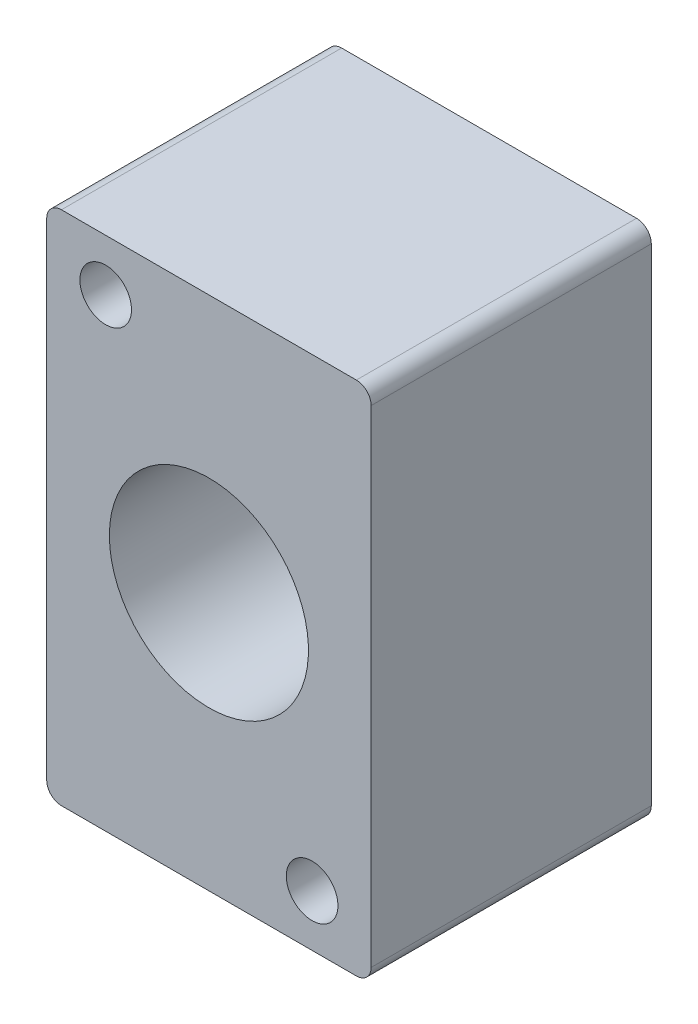
ISO-10303-21;
HEADER;
FILE_DESCRIPTION(('STEP AP214'),'2;1');
FILE_NAME('part.step','',(''),(''),'','','');
FILE_SCHEMA(('AUTOMOTIVE_DESIGN { 1 0 10303 214 1 1 1 1 }'));
ENDSEC;
DATA;
#1=APPLICATION_CONTEXT('core data for automotive mechanical design processes');
#2=APPLICATION_PROTOCOL_DEFINITION('international standard','automotive_design',2000,#1);
#3=PRODUCT_CONTEXT('',#1,'mechanical');
#4=PRODUCT('Part','Part','',(#3));
#5=PRODUCT_RELATED_PRODUCT_CATEGORY('part','',(#4));
#6=PRODUCT_DEFINITION_FORMATION('','',#4);
#7=PRODUCT_DEFINITION_CONTEXT('part definition',#1,'design');
#8=PRODUCT_DEFINITION('design','',#6,#7);
#9=PRODUCT_DEFINITION_SHAPE('','',#8);
#10=(LENGTH_UNIT() NAMED_UNIT(*) SI_UNIT(.MILLI.,.METRE.));
#11=(NAMED_UNIT(*) PLANE_ANGLE_UNIT() SI_UNIT($,.RADIAN.));
#12=(NAMED_UNIT(*) SI_UNIT($,.STERADIAN.) SOLID_ANGLE_UNIT());
#13=UNCERTAINTY_MEASURE_WITH_UNIT(LENGTH_MEASURE(1.E-05),#10,'distance_accuracy_value','');
#14=(GEOMETRIC_REPRESENTATION_CONTEXT(3) GLOBAL_UNCERTAINTY_ASSIGNED_CONTEXT((#13)) GLOBAL_UNIT_ASSIGNED_CONTEXT((#10,
#11,#12)) REPRESENTATION_CONTEXT('',''));
#15=CARTESIAN_POINT('',(0.,0.,0.));
#16=DIRECTION('',(0.,0.,1.));
#17=DIRECTION('',(1.,0.,0.));
#18=AXIS2_PLACEMENT_3D('',#15,#16,#17);
#19=CARTESIAN_POINT('',(4.13907958301551,17.4504195270786,44.));
#20=DIRECTION('',(0.,0.,1.));
#21=DIRECTION('',(1.,0.,0.));
#22=AXIS2_PLACEMENT_3D('',#19,#20,#21);
#23=CYLINDRICAL_SURFACE('',#22,1.);
#24=CARTESIAN_POINT('',(4.13907958301551,17.4504195270786,44.));
#25=DIRECTION('',(0.,0.,1.));
#26=DIRECTION('',(1.,0.,0.));
#27=AXIS2_PLACEMENT_3D('',#24,#25,#26);
#28=CIRCLE('',#27,1.);
#29=CARTESIAN_POINT('',(4.13907958301551,18.4504195270786,44.));
#30=VERTEX_POINT('',#29);
#31=CARTESIAN_POINT('',(5.13907958301551,17.4504195270786,44.));
#32=VERTEX_POINT('',#31);
#33=EDGE_CURVE('E89',#30,#32,#28,.F.);
#34=ORIENTED_EDGE('',*,*,#33,.T.);
#35=DIRECTION('',(0.,0.,1.));
#36=VECTOR('',#35,1.);
#37=CARTESIAN_POINT('',(5.13907958301551,17.4504195270786,44.));
#38=LINE('',#37,#36);
#39=CARTESIAN_POINT('',(5.13907958301551,17.4504195270786,25.));
#40=VERTEX_POINT('',#39);
#41=EDGE_CURVE('E91',#32,#40,#38,.F.);
#42=ORIENTED_EDGE('',*,*,#41,.T.);
#43=CARTESIAN_POINT('',(4.13907958301551,17.4504195270786,25.));
#44=DIRECTION('',(0.,0.,1.));
#45=DIRECTION('',(1.,0.,0.));
#46=AXIS2_PLACEMENT_3D('',#43,#44,#45);
#47=CIRCLE('',#46,1.);
#48=CARTESIAN_POINT('',(4.13907958301551,18.4504195270786,25.));
#49=VERTEX_POINT('',#48);
#50=EDGE_CURVE('E21',#40,#49,#47,.T.);
#51=ORIENTED_EDGE('',*,*,#50,.T.);
#52=DIRECTION('',(0.,0.,-1.));
#53=VECTOR('',#52,1.);
#54=CARTESIAN_POINT('',(4.13907958301551,18.4504195270786,44.));
#55=LINE('',#54,#53);
#56=EDGE_CURVE('E96',#49,#30,#55,.F.);
#57=ORIENTED_EDGE('',*,*,#56,.T.);
#58=EDGE_LOOP('',(#34,#42,#51,#57));
#59=FACE_BOUND('',#58,.T.);
#60=ADVANCED_FACE('F18',(#59),#23,.T.);
#61=CARTESIAN_POINT('',(4.13907958301551,-15.5495804729214,44.));
#62=DIRECTION('',(0.,0.,1.));
#63=DIRECTION('',(1.,0.,0.));
#64=AXIS2_PLACEMENT_3D('',#61,#62,#63);
#65=CYLINDRICAL_SURFACE('',#64,1.);
#66=CARTESIAN_POINT('',(4.13907958301551,-15.5495804729214,44.));
#67=DIRECTION('',(0.,0.,1.));
#68=DIRECTION('',(1.,0.,0.));
#69=AXIS2_PLACEMENT_3D('',#66,#67,#68);
#70=CIRCLE('',#69,1.);
#71=CARTESIAN_POINT('',(5.13907958301551,-15.5495804729214,44.));
#72=VERTEX_POINT('',#71);
#73=CARTESIAN_POINT('',(4.13907958301551,-16.5495804729214,44.));
#74=VERTEX_POINT('',#73);
#75=EDGE_CURVE('E114',#72,#74,#70,.F.);
#76=ORIENTED_EDGE('',*,*,#75,.T.);
#77=DIRECTION('',(0.,0.,1.));
#78=VECTOR('',#77,1.);
#79=CARTESIAN_POINT('',(4.13907958301551,-16.5495804729214,44.));
#80=LINE('',#79,#78);
#81=CARTESIAN_POINT('',(4.13907958301551,-16.5495804729214,25.));
#82=VERTEX_POINT('',#81);
#83=EDGE_CURVE('E102',#74,#82,#80,.F.);
#84=ORIENTED_EDGE('',*,*,#83,.T.);
#85=CARTESIAN_POINT('',(4.13907958301551,-15.5495804729214,25.));
#86=DIRECTION('',(0.,0.,1.));
#87=DIRECTION('',(1.,0.,0.));
#88=AXIS2_PLACEMENT_3D('',#85,#86,#87);
#89=CIRCLE('',#88,1.);
#90=CARTESIAN_POINT('',(5.13907958301551,-15.5495804729214,25.));
#91=VERTEX_POINT('',#90);
#92=EDGE_CURVE('E148',#82,#91,#89,.T.);
#93=ORIENTED_EDGE('',*,*,#92,.T.);
#94=DIRECTION('',(0.,0.,1.));
#95=VECTOR('',#94,1.);
#96=CARTESIAN_POINT('',(5.13907958301552,-15.5495804729214,44.));
#97=LINE('',#96,#95);
#98=EDGE_CURVE('E95',#91,#72,#97,.T.);
#99=ORIENTED_EDGE('',*,*,#98,.T.);
#100=EDGE_LOOP('',(#76,#84,#93,#99));
#101=FACE_BOUND('',#100,.T.);
#102=ADVANCED_FACE('F150',(#101),#65,.T.);
#103=CARTESIAN_POINT('',(-16.8609204169845,18.4504195270786,44.));
#104=DIRECTION('',(0.,-1.,0.));
#105=DIRECTION('',(0.,0.,-1.));
#106=AXIS2_PLACEMENT_3D('',#103,#104,#105);
#107=PLANE('',#106);
#108=DIRECTION('',(-1.,0.,0.));
#109=VECTOR('',#108,1.);
#110=CARTESIAN_POINT('',(-5.86092041698449,18.4504195270786,44.));
#111=LINE('',#110,#109);
#112=CARTESIAN_POINT('',(-15.8609204169845,18.4504195270786,44.));
#113=VERTEX_POINT('',#112);
#114=EDGE_CURVE('E136',#113,#30,#111,.F.);
#115=ORIENTED_EDGE('',*,*,#114,.T.);
#116=ORIENTED_EDGE('',*,*,#56,.F.);
#117=DIRECTION('',(-1.,0.,0.));
#118=VECTOR('',#117,1.);
#119=CARTESIAN_POINT('',(-5.86092041698449,18.4504195270786,25.));
#120=LINE('',#119,#118);
#121=CARTESIAN_POINT('',(-15.8609204169845,18.4504195270786,25.));
#122=VERTEX_POINT('',#121);
#123=EDGE_CURVE('E85',#122,#49,#120,.F.);
#124=ORIENTED_EDGE('',*,*,#123,.F.);
#125=DIRECTION('',(0.,0.,1.));
#126=VECTOR('',#125,1.);
#127=CARTESIAN_POINT('',(-15.8609204169845,18.4504195270786,44.));
#128=LINE('',#127,#126);
#129=EDGE_CURVE('E115',#113,#122,#128,.F.);
#130=ORIENTED_EDGE('',*,*,#129,.F.);
#131=EDGE_LOOP('',(#115,#116,#124,#130));
#132=FACE_BOUND('',#131,.T.);
#133=ADVANCED_FACE('F181',(#132),#107,.F.);
#134=CARTESIAN_POINT('',(5.13907958301551,18.4504195270786,44.));
#135=DIRECTION('',(-1.,0.,0.));
#136=DIRECTION('',(0.,-1.,0.));
#137=AXIS2_PLACEMENT_3D('',#134,#135,#136);
#138=PLANE('',#137);
#139=DIRECTION('',(0.,1.,0.));
#140=VECTOR('',#139,1.);
#141=CARTESIAN_POINT('',(5.13907958301551,0.950419527078566,25.));
#142=LINE('',#141,#140);
#143=EDGE_CURVE('E83',#40,#91,#142,.F.);
#144=ORIENTED_EDGE('',*,*,#143,.F.);
#145=ORIENTED_EDGE('',*,*,#41,.F.);
#146=DIRECTION('',(0.,1.,0.));
#147=VECTOR('',#146,1.);
#148=CARTESIAN_POINT('',(5.13907958301551,0.950419527078566,44.));
#149=LINE('',#148,#147);
#150=EDGE_CURVE('E162',#32,#72,#149,.F.);
#151=ORIENTED_EDGE('',*,*,#150,.T.);
#152=ORIENTED_EDGE('',*,*,#98,.F.);
#153=EDGE_LOOP('',(#144,#145,#151,#152));
#154=FACE_BOUND('',#153,.T.);
#155=ADVANCED_FACE('F99',(#154),#138,.F.);
#156=CARTESIAN_POINT('',(-5.86092041698449,0.950419527078566,25.));
#157=DIRECTION('',(0.,0.,-1.));
#158=DIRECTION('',(-1.,0.,0.));
#159=AXIS2_PLACEMENT_3D('',#156,#157,#158);
#160=CYLINDRICAL_SURFACE('',#159,6.75);
#161=CARTESIAN_POINT('',(-5.86092041698449,0.950419527078566,44.));
#162=DIRECTION('',(0.,0.,-1.));
#163=DIRECTION('',(-1.,0.,0.));
#164=AXIS2_PLACEMENT_3D('',#161,#162,#163);
#165=CIRCLE('',#164,6.75);
#166=CARTESIAN_POINT('',(-12.6109204169845,0.950419527078566,44.));
#167=VERTEX_POINT('',#166);
#168=EDGE_CURVE('E130',#167,#167,#165,.F.);
#169=ORIENTED_EDGE('',*,*,#168,.T.);
#170=EDGE_LOOP('',(#169));
#171=FACE_BOUND('',#170,.T.);
#172=CARTESIAN_POINT('',(-5.86092041698449,0.950419527078566,25.));
#173=DIRECTION('',(0.,0.,-1.));
#174=DIRECTION('',(-1.,0.,0.));
#175=AXIS2_PLACEMENT_3D('',#172,#173,#174);
#176=CIRCLE('',#175,6.75);
#177=CARTESIAN_POINT('',(-12.6109204169845,0.950419527078566,25.));
#178=VERTEX_POINT('',#177);
#179=EDGE_CURVE('E144',#178,#178,#176,.F.);
#180=ORIENTED_EDGE('',*,*,#179,.F.);
#181=EDGE_LOOP('',(#180));
#182=FACE_BOUND('',#181,.T.);
#183=ADVANCED_FACE('F190',(#171,#182),#160,.F.);
#184=CARTESIAN_POINT('',(-12.8609204169845,14.9504195270786,25.));
#185=DIRECTION('',(0.,0.,-1.));
#186=DIRECTION('',(-1.,0.,0.));
#187=AXIS2_PLACEMENT_3D('',#184,#185,#186);
#188=CYLINDRICAL_SURFACE('',#187,1.75);
#189=CARTESIAN_POINT('',(-12.8609204169845,14.9504195270786,44.));
#190=DIRECTION('',(0.,0.,-1.));
#191=DIRECTION('',(-1.,0.,0.));
#192=AXIS2_PLACEMENT_3D('',#189,#190,#191);
#193=CIRCLE('',#192,1.75);
#194=CARTESIAN_POINT('',(-14.6109204169845,14.9504195270786,44.));
#195=VERTEX_POINT('',#194);
#196=EDGE_CURVE('E127',#195,#195,#193,.F.);
#197=ORIENTED_EDGE('',*,*,#196,.T.);
#198=EDGE_LOOP('',(#197));
#199=FACE_BOUND('',#198,.T.);
#200=CARTESIAN_POINT('',(-12.8609204169845,14.9504195270786,25.));
#201=DIRECTION('',(0.,0.,-1.));
#202=DIRECTION('',(-1.,0.,0.));
#203=AXIS2_PLACEMENT_3D('',#200,#201,#202);
#204=CIRCLE('',#203,1.75);
#205=CARTESIAN_POINT('',(-14.6109204169845,14.9504195270786,25.));
#206=VERTEX_POINT('',#205);
#207=EDGE_CURVE('E141',#206,#206,#204,.F.);
#208=ORIENTED_EDGE('',*,*,#207,.F.);
#209=EDGE_LOOP('',(#208));
#210=FACE_BOUND('',#209,.T.);
#211=ADVANCED_FACE('F212',(#199,#210),#188,.F.);
#212=CARTESIAN_POINT('',(1.13907958301551,-13.0495804729214,25.));
#213=DIRECTION('',(0.,0.,-1.));
#214=DIRECTION('',(-1.,0.,0.));
#215=AXIS2_PLACEMENT_3D('',#212,#213,#214);
#216=CYLINDRICAL_SURFACE('',#215,1.75);
#217=CARTESIAN_POINT('',(1.13907958301551,-13.0495804729214,44.));
#218=DIRECTION('',(0.,0.,-1.));
#219=DIRECTION('',(-1.,0.,0.));
#220=AXIS2_PLACEMENT_3D('',#217,#218,#219);
#221=CIRCLE('',#220,1.75);
#222=CARTESIAN_POINT('',(-0.610920416984484,-13.0495804729214,44.));
#223=VERTEX_POINT('',#222);
#224=EDGE_CURVE('E124',#223,#223,#221,.F.);
#225=ORIENTED_EDGE('',*,*,#224,.T.);
#226=EDGE_LOOP('',(#225));
#227=FACE_BOUND('',#226,.T.);
#228=CARTESIAN_POINT('',(1.13907958301551,-13.0495804729214,25.));
#229=DIRECTION('',(0.,0.,-1.));
#230=DIRECTION('',(-1.,0.,0.));
#231=AXIS2_PLACEMENT_3D('',#228,#229,#230);
#232=CIRCLE('',#231,1.75);
#233=CARTESIAN_POINT('',(-0.610920416984484,-13.0495804729214,25.));
#234=VERTEX_POINT('',#233);
#235=EDGE_CURVE('E138',#234,#234,#232,.F.);
#236=ORIENTED_EDGE('',*,*,#235,.F.);
#237=EDGE_LOOP('',(#236));
#238=FACE_BOUND('',#237,.T.);
#239=ADVANCED_FACE('F209',(#227,#238),#216,.F.);
#240=CARTESIAN_POINT('',(5.13907958301552,-16.5495804729214,44.));
#241=DIRECTION('',(0.,1.,0.));
#242=DIRECTION('',(0.,0.,1.));
#243=AXIS2_PLACEMENT_3D('',#240,#241,#242);
#244=PLANE('',#243);
#245=DIRECTION('',(-1.,0.,0.));
#246=VECTOR('',#245,1.);
#247=CARTESIAN_POINT('',(-5.86092041698449,-16.5495804729214,25.));
#248=LINE('',#247,#246);
#249=CARTESIAN_POINT('',(-15.8609204169845,-16.5495804729214,25.));
#250=VERTEX_POINT('',#249);
#251=EDGE_CURVE('E101',#82,#250,#248,.T.);
#252=ORIENTED_EDGE('',*,*,#251,.F.);
#253=ORIENTED_EDGE('',*,*,#83,.F.);
#254=DIRECTION('',(-1.,0.,0.));
#255=VECTOR('',#254,1.);
#256=CARTESIAN_POINT('',(-5.86092041698449,-16.5495804729214,44.));
#257=LINE('',#256,#255);
#258=CARTESIAN_POINT('',(-15.8609204169845,-16.5495804729214,44.));
#259=VERTEX_POINT('',#258);
#260=EDGE_CURVE('E133',#74,#259,#257,.T.);
#261=ORIENTED_EDGE('',*,*,#260,.T.);
#262=DIRECTION('',(0.,0.,1.));
#263=VECTOR('',#262,1.);
#264=CARTESIAN_POINT('',(-15.8609204169845,-16.5495804729214,44.));
#265=LINE('',#264,#263);
#266=EDGE_CURVE('E109',#250,#259,#265,.T.);
#267=ORIENTED_EDGE('',*,*,#266,.F.);
#268=EDGE_LOOP('',(#252,#253,#261,#267));
#269=FACE_BOUND('',#268,.T.);
#270=ADVANCED_FACE('F159',(#269),#244,.F.);
#271=CARTESIAN_POINT('',(-5.86092041698449,0.950419527078566,25.));
#272=DIRECTION('',(0.,0.,-1.));
#273=DIRECTION('',(-1.,0.,0.));
#274=AXIS2_PLACEMENT_3D('',#271,#272,#273);
#275=PLANE('',#274);
#276=ORIENTED_EDGE('',*,*,#235,.T.);
#277=EDGE_LOOP('',(#276));
#278=FACE_BOUND('',#277,.T.);
#279=ORIENTED_EDGE('',*,*,#207,.T.);
#280=EDGE_LOOP('',(#279));
#281=FACE_BOUND('',#280,.T.);
#282=ORIENTED_EDGE('',*,*,#179,.T.);
#283=EDGE_LOOP('',(#282));
#284=FACE_BOUND('',#283,.T.);
#285=ORIENTED_EDGE('',*,*,#123,.T.);
#286=ORIENTED_EDGE('',*,*,#50,.F.);
#287=ORIENTED_EDGE('',*,*,#143,.T.);
#288=ORIENTED_EDGE('',*,*,#92,.F.);
#289=ORIENTED_EDGE('',*,*,#251,.T.);
#290=CARTESIAN_POINT('',(-15.8609204169845,-15.5495804729214,25.));
#291=DIRECTION('',(0.,0.,1.));
#292=DIRECTION('',(1.,0.,0.));
#293=AXIS2_PLACEMENT_3D('',#290,#291,#292);
#294=CIRCLE('',#293,1.);
#295=CARTESIAN_POINT('',(-16.8609204169845,-15.5495804729214,25.));
#296=VERTEX_POINT('',#295);
#297=EDGE_CURVE('E110',#296,#250,#294,.T.);
#298=ORIENTED_EDGE('',*,*,#297,.F.);
#299=DIRECTION('',(0.,1.,0.));
#300=VECTOR('',#299,1.);
#301=CARTESIAN_POINT('',(-16.8609204169845,-16.5495804729214,25.));
#302=LINE('',#301,#300);
#303=CARTESIAN_POINT('',(-16.8609204169845,17.4504195270786,25.));
#304=VERTEX_POINT('',#303);
#305=EDGE_CURVE('E121',#296,#304,#302,.T.);
#306=ORIENTED_EDGE('',*,*,#305,.T.);
#307=CARTESIAN_POINT('',(-15.8609204169845,17.4504195270786,25.));
#308=DIRECTION('',(0.,0.,1.));
#309=DIRECTION('',(1.,0.,0.));
#310=AXIS2_PLACEMENT_3D('',#307,#308,#309);
#311=CIRCLE('',#310,1.);
#312=EDGE_CURVE('E119',#122,#304,#311,.T.);
#313=ORIENTED_EDGE('',*,*,#312,.F.);
#314=EDGE_LOOP('',(#285,#286,#287,#288,#289,#298,#306,#313));
#315=FACE_BOUND('',#314,.T.);
#316=ADVANCED_FACE('F81',(#278,#281,#284,#315),#275,.T.);
#317=CARTESIAN_POINT('',(-15.8609204169845,17.4504195270786,44.));
#318=DIRECTION('',(0.,0.,1.));
#319=DIRECTION('',(1.,0.,0.));
#320=AXIS2_PLACEMENT_3D('',#317,#318,#319);
#321=CYLINDRICAL_SURFACE('',#320,1.);
#322=CARTESIAN_POINT('',(-15.8609204169845,17.4504195270786,44.));
#323=DIRECTION('',(0.,0.,1.));
#324=DIRECTION('',(1.,0.,0.));
#325=AXIS2_PLACEMENT_3D('',#322,#323,#324);
#326=CIRCLE('',#325,1.);
#327=CARTESIAN_POINT('',(-16.8609204169845,17.4504195270786,44.));
#328=VERTEX_POINT('',#327);
#329=EDGE_CURVE('E118',#328,#113,#326,.F.);
#330=ORIENTED_EDGE('',*,*,#329,.T.);
#331=ORIENTED_EDGE('',*,*,#129,.T.);
#332=ORIENTED_EDGE('',*,*,#312,.T.);
#333=DIRECTION('',(0.,0.,-1.));
#334=VECTOR('',#333,1.);
#335=CARTESIAN_POINT('',(-16.8609204169845,17.4504195270786,44.));
#336=LINE('',#335,#334);
#337=EDGE_CURVE('E171',#304,#328,#336,.F.);
#338=ORIENTED_EDGE('',*,*,#337,.T.);
#339=EDGE_LOOP('',(#330,#331,#332,#338));
#340=FACE_BOUND('',#339,.T.);
#341=ADVANCED_FACE('F178',(#340),#321,.T.);
#342=CARTESIAN_POINT('',(-5.86092041698449,0.950419527078566,44.));
#343=DIRECTION('',(0.,0.,-1.));
#344=DIRECTION('',(-1.,0.,0.));
#345=AXIS2_PLACEMENT_3D('',#342,#343,#344);
#346=PLANE('',#345);
#347=ORIENTED_EDGE('',*,*,#224,.F.);
#348=EDGE_LOOP('',(#347));
#349=FACE_BOUND('',#348,.T.);
#350=ORIENTED_EDGE('',*,*,#196,.F.);
#351=EDGE_LOOP('',(#350));
#352=FACE_BOUND('',#351,.T.);
#353=ORIENTED_EDGE('',*,*,#168,.F.);
#354=EDGE_LOOP('',(#353));
#355=FACE_BOUND('',#354,.T.);
#356=ORIENTED_EDGE('',*,*,#260,.F.);
#357=ORIENTED_EDGE('',*,*,#75,.F.);
#358=ORIENTED_EDGE('',*,*,#150,.F.);
#359=ORIENTED_EDGE('',*,*,#33,.F.);
#360=ORIENTED_EDGE('',*,*,#114,.F.);
#361=ORIENTED_EDGE('',*,*,#329,.F.);
#362=DIRECTION('',(0.,1.,0.));
#363=VECTOR('',#362,1.);
#364=CARTESIAN_POINT('',(-16.8609204169845,-16.5495804729214,44.));
#365=LINE('',#364,#363);
#366=CARTESIAN_POINT('',(-16.8609204169845,-15.5495804729214,44.));
#367=VERTEX_POINT('',#366);
#368=EDGE_CURVE('E27',#328,#367,#365,.F.);
#369=ORIENTED_EDGE('',*,*,#368,.T.);
#370=CARTESIAN_POINT('',(-15.8609204169845,-15.5495804729214,44.));
#371=DIRECTION('',(0.,0.,1.));
#372=DIRECTION('',(1.,0.,0.));
#373=AXIS2_PLACEMENT_3D('',#370,#371,#372);
#374=CIRCLE('',#373,1.);
#375=EDGE_CURVE('E35',#259,#367,#374,.F.);
#376=ORIENTED_EDGE('',*,*,#375,.F.);
#377=EDGE_LOOP('',(#356,#357,#358,#359,#360,#361,#369,#376));
#378=FACE_BOUND('',#377,.T.);
#379=ADVANCED_FACE('F165',(#349,#352,#355,#378),#346,.F.);
#380=CARTESIAN_POINT('',(-15.8609204169845,-15.5495804729214,44.));
#381=DIRECTION('',(0.,0.,1.));
#382=DIRECTION('',(1.,0.,0.));
#383=AXIS2_PLACEMENT_3D('',#380,#381,#382);
#384=CYLINDRICAL_SURFACE('',#383,1.);
#385=ORIENTED_EDGE('',*,*,#375,.T.);
#386=DIRECTION('',(0.,0.,-1.));
#387=VECTOR('',#386,1.);
#388=CARTESIAN_POINT('',(-16.8609204169845,-15.5495804729214,44.));
#389=LINE('',#388,#387);
#390=EDGE_CURVE('E11',#367,#296,#389,.T.);
#391=ORIENTED_EDGE('',*,*,#390,.T.);
#392=ORIENTED_EDGE('',*,*,#297,.T.);
#393=ORIENTED_EDGE('',*,*,#266,.T.);
#394=EDGE_LOOP('',(#385,#391,#392,#393));
#395=FACE_BOUND('',#394,.T.);
#396=ADVANCED_FACE('F157',(#395),#384,.T.);
#397=CARTESIAN_POINT('',(-16.8609204169845,-16.5495804729214,44.));
#398=DIRECTION('',(1.,0.,0.));
#399=DIRECTION('',(0.,0.,-1.));
#400=AXIS2_PLACEMENT_3D('',#397,#398,#399);
#401=PLANE('',#400);
#402=ORIENTED_EDGE('',*,*,#368,.F.);
#403=ORIENTED_EDGE('',*,*,#337,.F.);
#404=ORIENTED_EDGE('',*,*,#305,.F.);
#405=ORIENTED_EDGE('',*,*,#390,.F.);
#406=EDGE_LOOP('',(#402,#403,#404,#405));
#407=FACE_BOUND('',#406,.T.);
#408=ADVANCED_FACE('F176',(#407),#401,.F.);
#409=CLOSED_SHELL('',(#60,#102,#133,#155,#183,#211,#239,#270,#316,#341,#379,#396,#408));
#410=MANIFOLD_SOLID_BREP('B1',#409);
#411=ADVANCED_BREP_SHAPE_REPRESENTATION('',(#18,#410),#14);
#412=SHAPE_DEFINITION_REPRESENTATION(#9,#411);
ENDSEC;
END-ISO-10303-21;
